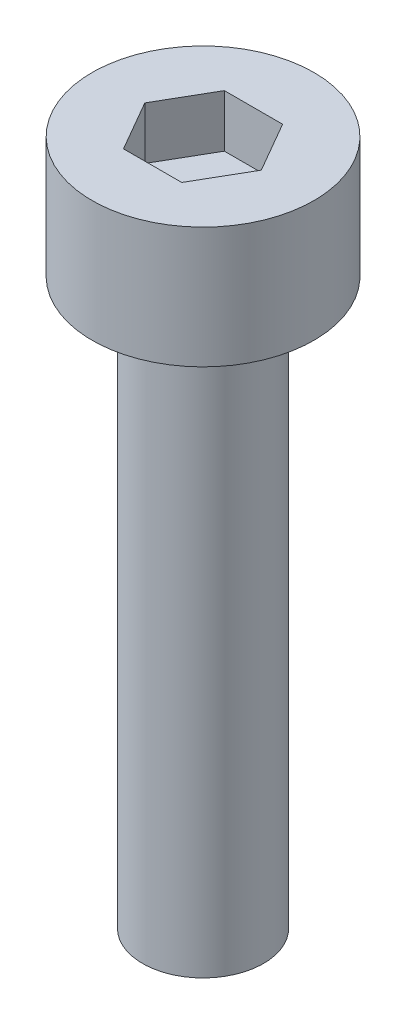
ISO-10303-21;
HEADER;
FILE_DESCRIPTION(('STEP AP214'),'2;1');
FILE_NAME('part.step','',(''),(''),'','','');
FILE_SCHEMA(('AUTOMOTIVE_DESIGN { 1 0 10303 214 1 1 1 1 }'));
ENDSEC;
DATA;
#1=APPLICATION_CONTEXT('core data for automotive mechanical design processes');
#2=APPLICATION_PROTOCOL_DEFINITION('international standard','automotive_design',2000,#1);
#3=PRODUCT_CONTEXT('',#1,'mechanical');
#4=PRODUCT('Part','Part','',(#3));
#5=PRODUCT_RELATED_PRODUCT_CATEGORY('part','',(#4));
#6=PRODUCT_DEFINITION_FORMATION('','',#4);
#7=PRODUCT_DEFINITION_CONTEXT('part definition',#1,'design');
#8=PRODUCT_DEFINITION('design','',#6,#7);
#9=PRODUCT_DEFINITION_SHAPE('','',#8);
#10=(LENGTH_UNIT() NAMED_UNIT(*) SI_UNIT(.MILLI.,.METRE.));
#11=(NAMED_UNIT(*) PLANE_ANGLE_UNIT() SI_UNIT($,.RADIAN.));
#12=(NAMED_UNIT(*) SI_UNIT($,.STERADIAN.) SOLID_ANGLE_UNIT());
#13=UNCERTAINTY_MEASURE_WITH_UNIT(LENGTH_MEASURE(1.E-05),#10,'distance_accuracy_value','');
#14=(GEOMETRIC_REPRESENTATION_CONTEXT(3) GLOBAL_UNCERTAINTY_ASSIGNED_CONTEXT((#13)) GLOBAL_UNIT_ASSIGNED_CONTEXT((#10,
#11,#12)) REPRESENTATION_CONTEXT('',''));
#15=CARTESIAN_POINT('',(0.,0.,0.));
#16=DIRECTION('',(0.,0.,1.));
#17=DIRECTION('',(1.,0.,0.));
#18=AXIS2_PLACEMENT_3D('',#15,#16,#17);
#19=CARTESIAN_POINT('',(0.,17.,0.));
#20=DIRECTION('',(0.,1.,0.));
#21=DIRECTION('',(0.,0.,1.));
#22=AXIS2_PLACEMENT_3D('',#19,#20,#21);
#23=PLANE('',#22);
#24=DIRECTION('',(-1.,0.,0.));
#25=VECTOR('',#24,1.);
#26=CARTESIAN_POINT('',(0.721687836487032,17.,-1.25));
#27=LINE('',#26,#25);
#28=CARTESIAN_POINT('',(0.721687836487032,17.,-1.25));
#29=VERTEX_POINT('',#28);
#30=CARTESIAN_POINT('',(-0.721687836487033,17.,-1.25));
#31=VERTEX_POINT('',#30);
#32=EDGE_CURVE('E46',#29,#31,#27,.T.);
#33=ORIENTED_EDGE('',*,*,#32,.F.);
#34=DIRECTION('',(-0.5,0.,-0.866025403784439));
#35=VECTOR('',#34,1.);
#36=CARTESIAN_POINT('',(1.44337567297406,17.,0.));
#37=LINE('',#36,#35);
#38=CARTESIAN_POINT('',(1.44337567297406,17.,0.));
#39=VERTEX_POINT('',#38);
#40=EDGE_CURVE('E129',#39,#29,#37,.T.);
#41=ORIENTED_EDGE('',*,*,#40,.F.);
#42=DIRECTION('',(0.5,0.,-0.866025403784439));
#43=VECTOR('',#42,1.);
#44=CARTESIAN_POINT('',(0.721687836487032,17.,1.25));
#45=LINE('',#44,#43);
#46=CARTESIAN_POINT('',(0.721687836487032,17.,1.25));
#47=VERTEX_POINT('',#46);
#48=EDGE_CURVE('E127',#47,#39,#45,.T.);
#49=ORIENTED_EDGE('',*,*,#48,.F.);
#50=DIRECTION('',(1.,0.,0.));
#51=VECTOR('',#50,1.);
#52=CARTESIAN_POINT('',(-0.721687836487033,17.,1.25));
#53=LINE('',#52,#51);
#54=CARTESIAN_POINT('',(-0.721687836487033,17.,1.25));
#55=VERTEX_POINT('',#54);
#56=EDGE_CURVE('E94',#55,#47,#53,.T.);
#57=ORIENTED_EDGE('',*,*,#56,.F.);
#58=DIRECTION('',(0.5,0.,0.866025403784439));
#59=VECTOR('',#58,1.);
#60=CARTESIAN_POINT('',(-1.44337567297406,17.,0.));
#61=LINE('',#60,#59);
#62=CARTESIAN_POINT('',(-1.44337567297406,17.,0.));
#63=VERTEX_POINT('',#62);
#64=EDGE_CURVE('E123',#63,#55,#61,.T.);
#65=ORIENTED_EDGE('',*,*,#64,.F.);
#66=DIRECTION('',(-0.5,0.,0.866025403784439));
#67=VECTOR('',#66,1.);
#68=CARTESIAN_POINT('',(-0.721687836487032,17.,-1.25));
#69=LINE('',#68,#67);
#70=EDGE_CURVE('E120',#31,#63,#69,.T.);
#71=ORIENTED_EDGE('',*,*,#70,.F.);
#72=EDGE_LOOP('',(#33,#41,#49,#57,#65,#71));
#73=FACE_BOUND('',#72,.T.);
#74=CARTESIAN_POINT('',(0.,17.,0.));
#75=DIRECTION('',(0.,-1.,0.));
#76=DIRECTION('',(0.,0.,-1.));
#77=AXIS2_PLACEMENT_3D('',#74,#75,#76);
#78=CIRCLE('',#77,2.75);
#79=CARTESIAN_POINT('',(0.,17.,-2.75));
#80=VERTEX_POINT('',#79);
#81=EDGE_CURVE('E11',#80,#80,#78,.T.);
#82=ORIENTED_EDGE('',*,*,#81,.F.);
#83=EDGE_LOOP('',(#82));
#84=FACE_BOUND('',#83,.T.);
#85=ADVANCED_FACE('F32',(#73,#84),#23,.T.);
#86=CARTESIAN_POINT('',(0.,0.,0.));
#87=DIRECTION('',(0.,-1.,0.));
#88=DIRECTION('',(0.,0.,-1.));
#89=AXIS2_PLACEMENT_3D('',#86,#87,#88);
#90=CYLINDRICAL_SURFACE('',#89,2.75);
#91=ORIENTED_EDGE('',*,*,#81,.T.);
#92=EDGE_LOOP('',(#91));
#93=FACE_BOUND('',#92,.T.);
#94=CARTESIAN_POINT('',(0.,14.,0.));
#95=DIRECTION('',(0.,-1.,0.));
#96=DIRECTION('',(0.,0.,-1.));
#97=AXIS2_PLACEMENT_3D('',#94,#95,#96);
#98=CIRCLE('',#97,2.75);
#99=CARTESIAN_POINT('',(0.,14.,-2.75));
#100=VERTEX_POINT('',#99);
#101=EDGE_CURVE('E39',#100,#100,#98,.T.);
#102=ORIENTED_EDGE('',*,*,#101,.F.);
#103=EDGE_LOOP('',(#102));
#104=FACE_BOUND('',#103,.T.);
#105=ADVANCED_FACE('F149',(#93,#104),#90,.T.);
#106=CARTESIAN_POINT('',(2.75,14.,0.));
#107=DIRECTION('',(0.,-1.,0.));
#108=DIRECTION('',(0.,0.,-1.));
#109=AXIS2_PLACEMENT_3D('',#106,#107,#108);
#110=PLANE('',#109);
#111=ORIENTED_EDGE('',*,*,#101,.T.);
#112=EDGE_LOOP('',(#111));
#113=FACE_BOUND('',#112,.T.);
#114=CARTESIAN_POINT('',(0.,14.,0.));
#115=DIRECTION('',(0.,-1.,0.));
#116=DIRECTION('',(0.,0.,-1.));
#117=AXIS2_PLACEMENT_3D('',#114,#115,#116);
#118=CIRCLE('',#117,1.5);
#119=CARTESIAN_POINT('',(0.,14.,-1.5));
#120=VERTEX_POINT('',#119);
#121=EDGE_CURVE('E141',#120,#120,#118,.T.);
#122=ORIENTED_EDGE('',*,*,#121,.F.);
#123=EDGE_LOOP('',(#122));
#124=FACE_BOUND('',#123,.T.);
#125=ADVANCED_FACE('F146',(#113,#124),#110,.T.);
#126=CARTESIAN_POINT('',(0.,0.,0.));
#127=DIRECTION('',(0.,-1.,0.));
#128=DIRECTION('',(0.,0.,-1.));
#129=AXIS2_PLACEMENT_3D('',#126,#127,#128);
#130=CYLINDRICAL_SURFACE('',#129,1.5);
#131=ORIENTED_EDGE('',*,*,#121,.T.);
#132=EDGE_LOOP('',(#131));
#133=FACE_BOUND('',#132,.T.);
#134=CARTESIAN_POINT('',(0.,0.,0.));
#135=DIRECTION('',(0.,-1.,0.));
#136=DIRECTION('',(0.,0.,-1.));
#137=AXIS2_PLACEMENT_3D('',#134,#135,#136);
#138=CIRCLE('',#137,1.5);
#139=CARTESIAN_POINT('',(0.,0.,-1.5));
#140=VERTEX_POINT('',#139);
#141=EDGE_CURVE('E133',#140,#140,#138,.T.);
#142=ORIENTED_EDGE('',*,*,#141,.F.);
#143=EDGE_LOOP('',(#142));
#144=FACE_BOUND('',#143,.T.);
#145=ADVANCED_FACE('F156',(#133,#144),#130,.T.);
#146=CARTESIAN_POINT('',(1.5,0.,0.));
#147=DIRECTION('',(0.,-1.,0.));
#148=DIRECTION('',(0.,0.,-1.));
#149=AXIS2_PLACEMENT_3D('',#146,#147,#148);
#150=PLANE('',#149);
#151=ORIENTED_EDGE('',*,*,#141,.T.);
#152=EDGE_LOOP('',(#151));
#153=FACE_BOUND('',#152,.T.);
#154=ADVANCED_FACE('F162',(#153),#150,.T.);
#155=CARTESIAN_POINT('',(0.721687836487032,15.7,-1.25));
#156=DIRECTION('',(0.,0.,-1.));
#157=DIRECTION('',(-1.,0.,0.));
#158=AXIS2_PLACEMENT_3D('',#155,#156,#157);
#159=PLANE('',#158);
#160=ORIENTED_EDGE('',*,*,#32,.T.);
#161=DIRECTION('',(0.,1.,0.));
#162=VECTOR('',#161,1.);
#163=CARTESIAN_POINT('',(-0.721687836487032,15.7,-1.25));
#164=LINE('',#163,#162);
#165=CARTESIAN_POINT('',(-0.721687836487032,15.7,-1.25));
#166=VERTEX_POINT('',#165);
#167=EDGE_CURVE('E76',#166,#31,#164,.T.);
#168=ORIENTED_EDGE('',*,*,#167,.F.);
#169=DIRECTION('',(-1.,0.,0.));
#170=VECTOR('',#169,1.);
#171=CARTESIAN_POINT('',(0.721687836487032,15.7,-1.25));
#172=LINE('',#171,#170);
#173=CARTESIAN_POINT('',(0.721687836487032,15.7,-1.25));
#174=VERTEX_POINT('',#173);
#175=EDGE_CURVE('E131',#174,#166,#172,.T.);
#176=ORIENTED_EDGE('',*,*,#175,.F.);
#177=DIRECTION('',(0.,1.,0.));
#178=VECTOR('',#177,1.);
#179=CARTESIAN_POINT('',(0.721687836487032,15.7,-1.25));
#180=LINE('',#179,#178);
#181=EDGE_CURVE('E54',#174,#29,#180,.T.);
#182=ORIENTED_EDGE('',*,*,#181,.T.);
#183=EDGE_LOOP('',(#160,#168,#176,#182));
#184=FACE_BOUND('',#183,.T.);
#185=ADVANCED_FACE('F166',(#184),#159,.F.);
#186=CARTESIAN_POINT('',(1.44337567297406,15.7,0.));
#187=DIRECTION('',(0.866025403784439,0.,-0.5));
#188=DIRECTION('',(-0.5,0.,-0.866025403784439));
#189=AXIS2_PLACEMENT_3D('',#186,#187,#188);
#190=PLANE('',#189);
#191=ORIENTED_EDGE('',*,*,#40,.T.);
#192=ORIENTED_EDGE('',*,*,#181,.F.);
#193=DIRECTION('',(-0.5,0.,-0.866025403784439));
#194=VECTOR('',#193,1.);
#195=CARTESIAN_POINT('',(1.44337567297406,15.7,0.));
#196=LINE('',#195,#194);
#197=CARTESIAN_POINT('',(1.44337567297406,15.7,0.));
#198=VERTEX_POINT('',#197);
#199=EDGE_CURVE('E106',#198,#174,#196,.T.);
#200=ORIENTED_EDGE('',*,*,#199,.F.);
#201=DIRECTION('',(0.,1.,0.));
#202=VECTOR('',#201,1.);
#203=CARTESIAN_POINT('',(1.44337567297406,15.7,0.));
#204=LINE('',#203,#202);
#205=EDGE_CURVE('E98',#198,#39,#204,.T.);
#206=ORIENTED_EDGE('',*,*,#205,.T.);
#207=EDGE_LOOP('',(#191,#192,#200,#206));
#208=FACE_BOUND('',#207,.T.);
#209=ADVANCED_FACE('F170',(#208),#190,.F.);
#210=CARTESIAN_POINT('',(0.721687836487032,15.7,1.25));
#211=DIRECTION('',(0.866025403784439,0.,0.5));
#212=DIRECTION('',(0.5,0.,-0.866025403784439));
#213=AXIS2_PLACEMENT_3D('',#210,#211,#212);
#214=PLANE('',#213);
#215=ORIENTED_EDGE('',*,*,#48,.T.);
#216=ORIENTED_EDGE('',*,*,#205,.F.);
#217=DIRECTION('',(0.5,0.,-0.866025403784439));
#218=VECTOR('',#217,1.);
#219=CARTESIAN_POINT('',(0.721687836487032,15.7,1.25));
#220=LINE('',#219,#218);
#221=CARTESIAN_POINT('',(0.721687836487032,15.7,1.25));
#222=VERTEX_POINT('',#221);
#223=EDGE_CURVE('E102',#222,#198,#220,.T.);
#224=ORIENTED_EDGE('',*,*,#223,.F.);
#225=DIRECTION('',(0.,1.,0.));
#226=VECTOR('',#225,1.);
#227=CARTESIAN_POINT('',(0.721687836487032,15.7,1.25));
#228=LINE('',#227,#226);
#229=EDGE_CURVE('E87',#222,#47,#228,.T.);
#230=ORIENTED_EDGE('',*,*,#229,.T.);
#231=EDGE_LOOP('',(#215,#216,#224,#230));
#232=FACE_BOUND('',#231,.T.);
#233=ADVANCED_FACE('F103',(#232),#214,.F.);
#234=CARTESIAN_POINT('',(-0.721687836487033,15.7,1.25));
#235=DIRECTION('',(0.,0.,1.));
#236=DIRECTION('',(1.,0.,0.));
#237=AXIS2_PLACEMENT_3D('',#234,#235,#236);
#238=PLANE('',#237);
#239=ORIENTED_EDGE('',*,*,#56,.T.);
#240=ORIENTED_EDGE('',*,*,#229,.F.);
#241=DIRECTION('',(1.,0.,0.));
#242=VECTOR('',#241,1.);
#243=CARTESIAN_POINT('',(-0.721687836487033,15.7,1.25));
#244=LINE('',#243,#242);
#245=CARTESIAN_POINT('',(-0.721687836487033,15.7,1.25));
#246=VERTEX_POINT('',#245);
#247=EDGE_CURVE('E91',#246,#222,#244,.T.);
#248=ORIENTED_EDGE('',*,*,#247,.F.);
#249=DIRECTION('',(0.,1.,0.));
#250=VECTOR('',#249,1.);
#251=CARTESIAN_POINT('',(-0.721687836487033,15.7,1.25));
#252=LINE('',#251,#250);
#253=EDGE_CURVE('E99',#246,#55,#252,.T.);
#254=ORIENTED_EDGE('',*,*,#253,.T.);
#255=EDGE_LOOP('',(#239,#240,#248,#254));
#256=FACE_BOUND('',#255,.T.);
#257=ADVANCED_FACE('F89',(#256),#238,.F.);
#258=CARTESIAN_POINT('',(-1.44337567297406,15.7,0.));
#259=DIRECTION('',(-0.866025403784439,0.,0.5));
#260=DIRECTION('',(0.5,0.,0.866025403784439));
#261=AXIS2_PLACEMENT_3D('',#258,#259,#260);
#262=PLANE('',#261);
#263=ORIENTED_EDGE('',*,*,#64,.T.);
#264=ORIENTED_EDGE('',*,*,#253,.F.);
#265=DIRECTION('',(0.5,0.,0.866025403784439));
#266=VECTOR('',#265,1.);
#267=CARTESIAN_POINT('',(-1.44337567297406,15.7,0.));
#268=LINE('',#267,#266);
#269=CARTESIAN_POINT('',(-1.44337567297406,15.7,0.));
#270=VERTEX_POINT('',#269);
#271=EDGE_CURVE('E112',#270,#246,#268,.T.);
#272=ORIENTED_EDGE('',*,*,#271,.F.);
#273=DIRECTION('',(0.,1.,0.));
#274=VECTOR('',#273,1.);
#275=CARTESIAN_POINT('',(-1.44337567297406,15.7,0.));
#276=LINE('',#275,#274);
#277=EDGE_CURVE('E136',#270,#63,#276,.T.);
#278=ORIENTED_EDGE('',*,*,#277,.T.);
#279=EDGE_LOOP('',(#263,#264,#272,#278));
#280=FACE_BOUND('',#279,.T.);
#281=ADVANCED_FACE('F174',(#280),#262,.F.);
#282=CARTESIAN_POINT('',(-0.721687836487032,15.7,-1.25));
#283=DIRECTION('',(-0.866025403784439,0.,-0.5));
#284=DIRECTION('',(-0.5,0.,0.866025403784439));
#285=AXIS2_PLACEMENT_3D('',#282,#283,#284);
#286=PLANE('',#285);
#287=ORIENTED_EDGE('',*,*,#70,.T.);
#288=ORIENTED_EDGE('',*,*,#277,.F.);
#289=DIRECTION('',(-0.5,0.,0.866025403784439));
#290=VECTOR('',#289,1.);
#291=CARTESIAN_POINT('',(-0.721687836487032,15.7,-1.25));
#292=LINE('',#291,#290);
#293=EDGE_CURVE('E114',#166,#270,#292,.T.);
#294=ORIENTED_EDGE('',*,*,#293,.F.);
#295=ORIENTED_EDGE('',*,*,#167,.T.);
#296=EDGE_LOOP('',(#287,#288,#294,#295));
#297=FACE_BOUND('',#296,.T.);
#298=ADVANCED_FACE('F171',(#297),#286,.F.);
#299=CARTESIAN_POINT('',(-0.721687836487032,15.7,-1.25));
#300=DIRECTION('',(0.,1.,0.));
#301=DIRECTION('',(0.,0.,1.));
#302=AXIS2_PLACEMENT_3D('',#299,#300,#301);
#303=PLANE('',#302);
#304=ORIENTED_EDGE('',*,*,#175,.T.);
#305=ORIENTED_EDGE('',*,*,#293,.T.);
#306=ORIENTED_EDGE('',*,*,#271,.T.);
#307=ORIENTED_EDGE('',*,*,#247,.T.);
#308=ORIENTED_EDGE('',*,*,#223,.T.);
#309=ORIENTED_EDGE('',*,*,#199,.T.);
#310=EDGE_LOOP('',(#304,#305,#306,#307,#308,#309));
#311=FACE_BOUND('',#310,.T.);
#312=ADVANCED_FACE('F109',(#311),#303,.T.);
#313=CLOSED_SHELL('',(#85,#105,#125,#145,#154,#185,#209,#233,#257,#281,#298,#312));
#314=MANIFOLD_SOLID_BREP('B2',#313);
#315=ADVANCED_BREP_SHAPE_REPRESENTATION('',(#18,#314),#14);
#316=SHAPE_DEFINITION_REPRESENTATION(#9,#315);
ENDSEC;
END-ISO-10303-21;
